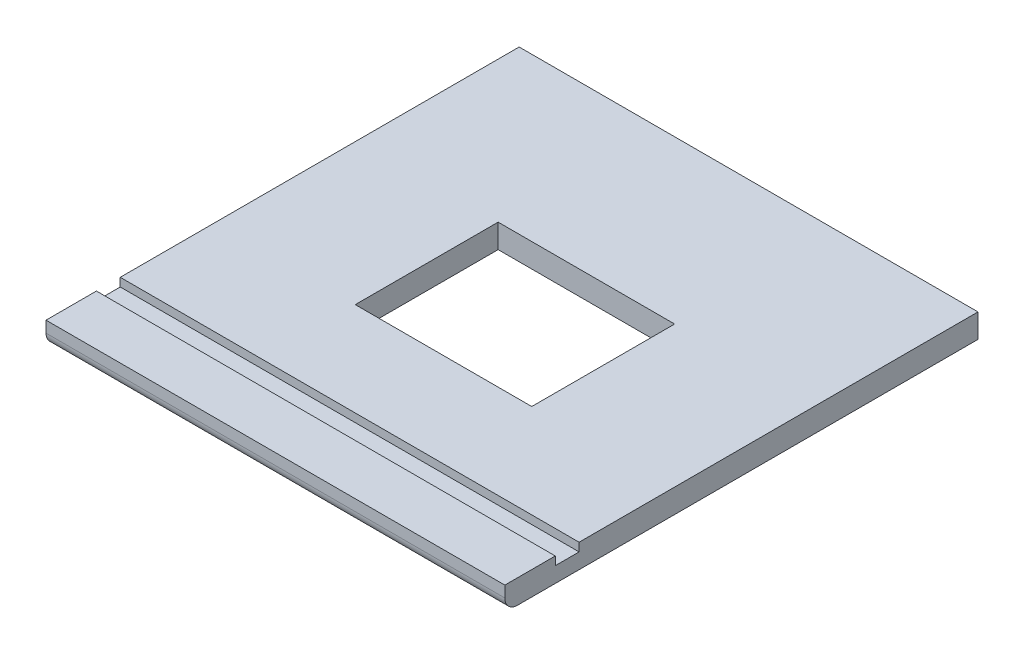
ISO-10303-21;
HEADER;
FILE_DESCRIPTION(('STEP AP214'),'2;1');
FILE_NAME('part.step','',(''),(''),'','','');
FILE_SCHEMA(('AUTOMOTIVE_DESIGN { 1 0 10303 214 1 1 1 1 }'));
ENDSEC;
DATA;
#1=APPLICATION_CONTEXT('core data for automotive mechanical design processes');
#2=APPLICATION_PROTOCOL_DEFINITION('international standard','automotive_design',2000,#1);
#3=PRODUCT_CONTEXT('',#1,'mechanical');
#4=PRODUCT('Part','Part','',(#3));
#5=PRODUCT_RELATED_PRODUCT_CATEGORY('part','',(#4));
#6=PRODUCT_DEFINITION_FORMATION('','',#4);
#7=PRODUCT_DEFINITION_CONTEXT('part definition',#1,'design');
#8=PRODUCT_DEFINITION('design','',#6,#7);
#9=PRODUCT_DEFINITION_SHAPE('','',#8);
#10=(LENGTH_UNIT() NAMED_UNIT(*) SI_UNIT(.MILLI.,.METRE.));
#11=(NAMED_UNIT(*) PLANE_ANGLE_UNIT() SI_UNIT($,.RADIAN.));
#12=(NAMED_UNIT(*) SI_UNIT($,.STERADIAN.) SOLID_ANGLE_UNIT());
#13=UNCERTAINTY_MEASURE_WITH_UNIT(LENGTH_MEASURE(1.E-05),#10,'distance_accuracy_value','');
#14=(GEOMETRIC_REPRESENTATION_CONTEXT(3) GLOBAL_UNCERTAINTY_ASSIGNED_CONTEXT((#13)) GLOBAL_UNIT_ASSIGNED_CONTEXT((#10,
#11,#12)) REPRESENTATION_CONTEXT('',''));
#15=CARTESIAN_POINT('',(0.,0.,0.));
#16=DIRECTION('',(0.,0.,1.));
#17=DIRECTION('',(1.,0.,0.));
#18=AXIS2_PLACEMENT_3D('',#15,#16,#17);
#19=CARTESIAN_POINT('',(0.,18.,0.));
#20=DIRECTION('',(0.,1.,0.));
#21=DIRECTION('',(0.,0.,1.));
#22=AXIS2_PLACEMENT_3D('',#19,#20,#21);
#23=PLANE('',#22);
#24=DIRECTION('',(1.,0.,0.));
#25=VECTOR('',#24,1.);
#26=CARTESIAN_POINT('',(346.7,18.,319.40000001));
#27=LINE('',#26,#25);
#28=CARTESIAN_POINT('',(0.,18.,319.40000001));
#29=VERTEX_POINT('',#28);
#30=CARTESIAN_POINT('',(346.7,18.,319.40000001));
#31=VERTEX_POINT('',#30);
#32=EDGE_CURVE('E173',#29,#31,#27,.T.);
#33=ORIENTED_EDGE('',*,*,#32,.F.);
#34=DIRECTION('',(0.,0.,1.));
#35=VECTOR('',#34,1.);
#36=CARTESIAN_POINT('',(0.,18.,0.));
#37=LINE('',#36,#35);
#38=CARTESIAN_POINT('',(0.,18.,357.50000001));
#39=VERTEX_POINT('',#38);
#40=EDGE_CURVE('E198',#29,#39,#37,.T.);
#41=ORIENTED_EDGE('',*,*,#40,.T.);
#42=DIRECTION('',(1.,0.,0.));
#43=VECTOR('',#42,1.);
#44=CARTESIAN_POINT('',(0.,18.,357.50000001));
#45=LINE('',#44,#43);
#46=CARTESIAN_POINT('',(346.7,18.,357.50000001));
#47=VERTEX_POINT('',#46);
#48=EDGE_CURVE('E197',#39,#47,#45,.T.);
#49=ORIENTED_EDGE('',*,*,#48,.T.);
#50=DIRECTION('',(0.,0.,-1.));
#51=VECTOR('',#50,1.);
#52=CARTESIAN_POINT('',(346.7,18.,0.));
#53=LINE('',#52,#51);
#54=EDGE_CURVE('E201',#47,#31,#53,.T.);
#55=ORIENTED_EDGE('',*,*,#54,.T.);
#56=EDGE_LOOP('',(#33,#41,#49,#55));
#57=FACE_BOUND('',#56,.T.);
#58=ADVANCED_FACE('F32',(#57),#23,.T.);
#59=CARTESIAN_POINT('',(0.,18.,0.));
#60=DIRECTION('',(1.,0.,0.));
#61=DIRECTION('',(0.,0.,-1.));
#62=AXIS2_PLACEMENT_3D('',#59,#60,#61);
#63=PLANE('',#62);
#64=DIRECTION('',(0.,0.,1.));
#65=VECTOR('',#64,1.);
#66=CARTESIAN_POINT('',(0.,0.,0.));
#67=LINE('',#66,#65);
#68=CARTESIAN_POINT('',(0.,0.,0.));
#69=VERTEX_POINT('',#68);
#70=CARTESIAN_POINT('',(0.,0.,347.97500001));
#71=VERTEX_POINT('',#70);
#72=EDGE_CURVE('E187',#69,#71,#67,.T.);
#73=ORIENTED_EDGE('',*,*,#72,.T.);
#74=CARTESIAN_POINT('',(0.,9.525,347.97500001));
#75=DIRECTION('',(1.,0.,0.));
#76=DIRECTION('',(0.,0.,-1.));
#77=AXIS2_PLACEMENT_3D('',#74,#75,#76);
#78=CIRCLE('',#77,9.525);
#79=CARTESIAN_POINT('',(0.,9.525,357.50000001));
#80=VERTEX_POINT('',#79);
#81=EDGE_CURVE('E11',#71,#80,#78,.F.);
#82=ORIENTED_EDGE('',*,*,#81,.T.);
#83=DIRECTION('',(0.,-1.,0.));
#84=VECTOR('',#83,1.);
#85=CARTESIAN_POINT('',(0.,18.,357.50000001));
#86=LINE('',#85,#84);
#87=EDGE_CURVE('E219',#39,#80,#86,.T.);
#88=ORIENTED_EDGE('',*,*,#87,.F.);
#89=ORIENTED_EDGE('',*,*,#40,.F.);
#90=DIRECTION('',(0.,1.,0.));
#91=VECTOR('',#90,1.);
#92=CARTESIAN_POINT('',(0.,11.65,319.40000001));
#93=LINE('',#92,#91);
#94=CARTESIAN_POINT('',(0.,11.65,319.40000001));
#95=VERTEX_POINT('',#94);
#96=EDGE_CURVE('E188',#95,#29,#93,.T.);
#97=ORIENTED_EDGE('',*,*,#96,.F.);
#98=DIRECTION('',(0.,0.,1.));
#99=VECTOR('',#98,1.);
#100=CARTESIAN_POINT('',(0.,11.65,319.40000001));
#101=LINE('',#100,#99);
#102=CARTESIAN_POINT('',(0.,11.65,301.40000001));
#103=VERTEX_POINT('',#102);
#104=EDGE_CURVE('E176',#103,#95,#101,.T.);
#105=ORIENTED_EDGE('',*,*,#104,.F.);
#106=DIRECTION('',(0.,1.,0.));
#107=VECTOR('',#106,1.);
#108=CARTESIAN_POINT('',(0.,11.65,301.40000001));
#109=LINE('',#108,#107);
#110=CARTESIAN_POINT('',(0.,18.,301.40000001));
#111=VERTEX_POINT('',#110);
#112=EDGE_CURVE('E190',#103,#111,#109,.T.);
#113=ORIENTED_EDGE('',*,*,#112,.T.);
#114=CARTESIAN_POINT('',(0.,18.,0.));
#115=VERTEX_POINT('',#114);
#116=EDGE_CURVE('E194',#115,#111,#37,.T.);
#117=ORIENTED_EDGE('',*,*,#116,.F.);
#118=DIRECTION('',(0.,-1.,0.));
#119=VECTOR('',#118,1.);
#120=CARTESIAN_POINT('',(0.,18.,0.));
#121=LINE('',#120,#119);
#122=EDGE_CURVE('E206',#115,#69,#121,.T.);
#123=ORIENTED_EDGE('',*,*,#122,.T.);
#124=EDGE_LOOP('',(#73,#82,#88,#89,#97,#105,#113,#117,#123));
#125=FACE_BOUND('',#124,.T.);
#126=ADVANCED_FACE('F240',(#125),#63,.F.);
#127=CARTESIAN_POINT('',(0.,18.,357.50000001));
#128=DIRECTION('',(0.,0.,-1.));
#129=DIRECTION('',(-1.,0.,0.));
#130=AXIS2_PLACEMENT_3D('',#127,#128,#129);
#131=PLANE('',#130);
#132=ORIENTED_EDGE('',*,*,#87,.T.);
#133=DIRECTION('',(1.,0.,0.));
#134=VECTOR('',#133,1.);
#135=CARTESIAN_POINT('',(0.,9.525,357.50000001));
#136=LINE('',#135,#134);
#137=CARTESIAN_POINT('',(346.7,9.525,357.50000001));
#138=VERTEX_POINT('',#137);
#139=EDGE_CURVE('E222',#80,#138,#136,.T.);
#140=ORIENTED_EDGE('',*,*,#139,.T.);
#141=DIRECTION('',(0.,-1.,0.));
#142=VECTOR('',#141,1.);
#143=CARTESIAN_POINT('',(346.7,18.,357.50000001));
#144=LINE('',#143,#142);
#145=EDGE_CURVE('E217',#47,#138,#144,.T.);
#146=ORIENTED_EDGE('',*,*,#145,.F.);
#147=ORIENTED_EDGE('',*,*,#48,.F.);
#148=EDGE_LOOP('',(#132,#140,#146,#147));
#149=FACE_BOUND('',#148,.T.);
#150=ADVANCED_FACE('F228',(#149),#131,.F.);
#151=CARTESIAN_POINT('',(346.7,18.,0.));
#152=DIRECTION('',(-1.,0.,0.));
#153=DIRECTION('',(0.,0.,1.));
#154=AXIS2_PLACEMENT_3D('',#151,#152,#153);
#155=PLANE('',#154);
#156=ORIENTED_EDGE('',*,*,#145,.T.);
#157=CARTESIAN_POINT('',(346.7,9.525,347.97500001));
#158=DIRECTION('',(-1.,0.,0.));
#159=DIRECTION('',(0.,0.,1.));
#160=AXIS2_PLACEMENT_3D('',#157,#158,#159);
#161=CIRCLE('',#160,9.525);
#162=CARTESIAN_POINT('',(346.7,0.,347.97500001));
#163=VERTEX_POINT('',#162);
#164=EDGE_CURVE('E54',#138,#163,#161,.F.);
#165=ORIENTED_EDGE('',*,*,#164,.T.);
#166=DIRECTION('',(0.,0.,-1.));
#167=VECTOR('',#166,1.);
#168=CARTESIAN_POINT('',(346.7,0.,0.));
#169=LINE('',#168,#167);
#170=CARTESIAN_POINT('',(346.7,0.,0.));
#171=VERTEX_POINT('',#170);
#172=EDGE_CURVE('E208',#163,#171,#169,.T.);
#173=ORIENTED_EDGE('',*,*,#172,.T.);
#174=DIRECTION('',(0.,-1.,0.));
#175=VECTOR('',#174,1.);
#176=CARTESIAN_POINT('',(346.7,18.,0.));
#177=LINE('',#176,#175);
#178=CARTESIAN_POINT('',(346.7,18.,0.));
#179=VERTEX_POINT('',#178);
#180=EDGE_CURVE('E214',#179,#171,#177,.T.);
#181=ORIENTED_EDGE('',*,*,#180,.F.);
#182=CARTESIAN_POINT('',(346.7,18.,301.40000001));
#183=VERTEX_POINT('',#182);
#184=EDGE_CURVE('E200',#183,#179,#53,.T.);
#185=ORIENTED_EDGE('',*,*,#184,.F.);
#186=DIRECTION('',(0.,1.,0.));
#187=VECTOR('',#186,1.);
#188=CARTESIAN_POINT('',(346.7,11.65,301.40000001));
#189=LINE('',#188,#187);
#190=CARTESIAN_POINT('',(346.7,11.65,301.40000001));
#191=VERTEX_POINT('',#190);
#192=EDGE_CURVE('E181',#191,#183,#189,.T.);
#193=ORIENTED_EDGE('',*,*,#192,.F.);
#194=DIRECTION('',(0.,0.,-1.));
#195=VECTOR('',#194,1.);
#196=CARTESIAN_POINT('',(346.7,11.65,319.40000001));
#197=LINE('',#196,#195);
#198=CARTESIAN_POINT('',(346.7,11.65,319.40000001));
#199=VERTEX_POINT('',#198);
#200=EDGE_CURVE('E169',#199,#191,#197,.T.);
#201=ORIENTED_EDGE('',*,*,#200,.F.);
#202=DIRECTION('',(0.,1.,0.));
#203=VECTOR('',#202,1.);
#204=CARTESIAN_POINT('',(346.7,11.65,319.40000001));
#205=LINE('',#204,#203);
#206=EDGE_CURVE('E184',#199,#31,#205,.T.);
#207=ORIENTED_EDGE('',*,*,#206,.T.);
#208=ORIENTED_EDGE('',*,*,#54,.F.);
#209=EDGE_LOOP('',(#156,#165,#173,#181,#185,#193,#201,#207,#208));
#210=FACE_BOUND('',#209,.T.);
#211=ADVANCED_FACE('F234',(#210),#155,.F.);
#212=CARTESIAN_POINT('',(0.,18.,0.));
#213=DIRECTION('',(0.,0.,1.));
#214=DIRECTION('',(1.,0.,0.));
#215=AXIS2_PLACEMENT_3D('',#212,#213,#214);
#216=PLANE('',#215);
#217=DIRECTION('',(-1.,0.,0.));
#218=VECTOR('',#217,1.);
#219=CARTESIAN_POINT('',(0.,0.,0.));
#220=LINE('',#219,#218);
#221=EDGE_CURVE('E210',#171,#69,#220,.T.);
#222=ORIENTED_EDGE('',*,*,#221,.T.);
#223=ORIENTED_EDGE('',*,*,#122,.F.);
#224=DIRECTION('',(-1.,0.,0.));
#225=VECTOR('',#224,1.);
#226=CARTESIAN_POINT('',(0.,18.,0.));
#227=LINE('',#226,#225);
#228=EDGE_CURVE('E204',#179,#115,#227,.T.);
#229=ORIENTED_EDGE('',*,*,#228,.F.);
#230=ORIENTED_EDGE('',*,*,#180,.T.);
#231=EDGE_LOOP('',(#222,#223,#229,#230));
#232=FACE_BOUND('',#231,.T.);
#233=ADVANCED_FACE('F258',(#232),#216,.F.);
#234=DIRECTION('',(0.,0.,1.));
#235=VECTOR('',#234,1.);
#236=CARTESIAN_POINT('',(106.675,18.,230.50000001));
#237=LINE('',#236,#235);
#238=CARTESIAN_POINT('',(106.675,18.,122.55000001));
#239=VERTEX_POINT('',#238);
#240=CARTESIAN_POINT('',(106.675,18.,230.50000001));
#241=VERTEX_POINT('',#240);
#242=EDGE_CURVE('E133',#239,#241,#237,.T.);
#243=ORIENTED_EDGE('',*,*,#242,.F.);
#244=DIRECTION('',(-1.,0.,0.));
#245=VECTOR('',#244,1.);
#246=CARTESIAN_POINT('',(106.675,18.,122.55000001));
#247=LINE('',#246,#245);
#248=CARTESIAN_POINT('',(240.025,18.,122.55000001));
#249=VERTEX_POINT('',#248);
#250=EDGE_CURVE('E150',#249,#239,#247,.T.);
#251=ORIENTED_EDGE('',*,*,#250,.F.);
#252=DIRECTION('',(0.,0.,-1.));
#253=VECTOR('',#252,1.);
#254=CARTESIAN_POINT('',(240.025,18.,230.50000001));
#255=LINE('',#254,#253);
#256=CARTESIAN_POINT('',(240.025,18.,230.50000001));
#257=VERTEX_POINT('',#256);
#258=EDGE_CURVE('E153',#257,#249,#255,.T.);
#259=ORIENTED_EDGE('',*,*,#258,.F.);
#260=DIRECTION('',(1.,0.,0.));
#261=VECTOR('',#260,1.);
#262=CARTESIAN_POINT('',(106.675,18.,230.50000001));
#263=LINE('',#262,#261);
#264=EDGE_CURVE('E159',#241,#257,#263,.T.);
#265=ORIENTED_EDGE('',*,*,#264,.F.);
#266=EDGE_LOOP('',(#243,#251,#259,#265));
#267=FACE_BOUND('',#266,.T.);
#268=DIRECTION('',(-1.,0.,0.));
#269=VECTOR('',#268,1.);
#270=CARTESIAN_POINT('',(346.7,18.,301.40000001));
#271=LINE('',#270,#269);
#272=EDGE_CURVE('E165',#183,#111,#271,.T.);
#273=ORIENTED_EDGE('',*,*,#272,.F.);
#274=ORIENTED_EDGE('',*,*,#184,.T.);
#275=ORIENTED_EDGE('',*,*,#228,.T.);
#276=ORIENTED_EDGE('',*,*,#116,.T.);
#277=EDGE_LOOP('',(#273,#274,#275,#276));
#278=FACE_BOUND('',#277,.T.);
#279=ADVANCED_FACE('F250',(#267,#278),#23,.T.);
#280=CARTESIAN_POINT('',(0.,0.,0.));
#281=DIRECTION('',(0.,1.,0.));
#282=DIRECTION('',(0.,0.,1.));
#283=AXIS2_PLACEMENT_3D('',#280,#281,#282);
#284=PLANE('',#283);
#285=DIRECTION('',(-1.,0.,0.));
#286=VECTOR('',#285,1.);
#287=CARTESIAN_POINT('',(106.675,0.,122.55000001));
#288=LINE('',#287,#286);
#289=CARTESIAN_POINT('',(240.025,0.,122.55000001));
#290=VERTEX_POINT('',#289);
#291=CARTESIAN_POINT('',(106.675,0.,122.55000001));
#292=VERTEX_POINT('',#291);
#293=EDGE_CURVE('E138',#290,#292,#288,.T.);
#294=ORIENTED_EDGE('',*,*,#293,.T.);
#295=DIRECTION('',(0.,0.,1.));
#296=VECTOR('',#295,1.);
#297=CARTESIAN_POINT('',(106.675,0.,230.50000001));
#298=LINE('',#297,#296);
#299=CARTESIAN_POINT('',(106.675,0.,230.50000001));
#300=VERTEX_POINT('',#299);
#301=EDGE_CURVE('E130',#292,#300,#298,.T.);
#302=ORIENTED_EDGE('',*,*,#301,.T.);
#303=DIRECTION('',(1.,0.,0.));
#304=VECTOR('',#303,1.);
#305=CARTESIAN_POINT('',(106.675,0.,230.50000001));
#306=LINE('',#305,#304);
#307=CARTESIAN_POINT('',(240.025,0.,230.50000001));
#308=VERTEX_POINT('',#307);
#309=EDGE_CURVE('E142',#300,#308,#306,.T.);
#310=ORIENTED_EDGE('',*,*,#309,.T.);
#311=DIRECTION('',(0.,0.,-1.));
#312=VECTOR('',#311,1.);
#313=CARTESIAN_POINT('',(240.025,0.,230.50000001));
#314=LINE('',#313,#312);
#315=EDGE_CURVE('E146',#308,#290,#314,.T.);
#316=ORIENTED_EDGE('',*,*,#315,.T.);
#317=EDGE_LOOP('',(#294,#302,#310,#316));
#318=FACE_BOUND('',#317,.T.);
#319=ORIENTED_EDGE('',*,*,#172,.F.);
#320=DIRECTION('',(1.,0.,0.));
#321=VECTOR('',#320,1.);
#322=CARTESIAN_POINT('',(0.,0.,347.97500001));
#323=LINE('',#322,#321);
#324=EDGE_CURVE('E40',#163,#71,#323,.F.);
#325=ORIENTED_EDGE('',*,*,#324,.T.);
#326=ORIENTED_EDGE('',*,*,#72,.F.);
#327=ORIENTED_EDGE('',*,*,#221,.F.);
#328=EDGE_LOOP('',(#319,#325,#326,#327));
#329=FACE_BOUND('',#328,.T.);
#330=ADVANCED_FACE('F148',(#318,#329),#284,.F.);
#331=CARTESIAN_POINT('',(346.7,11.65,319.40000001));
#332=DIRECTION('',(0.,0.,1.));
#333=DIRECTION('',(1.,0.,0.));
#334=AXIS2_PLACEMENT_3D('',#331,#332,#333);
#335=PLANE('',#334);
#336=ORIENTED_EDGE('',*,*,#32,.T.);
#337=ORIENTED_EDGE('',*,*,#206,.F.);
#338=DIRECTION('',(1.,0.,0.));
#339=VECTOR('',#338,1.);
#340=CARTESIAN_POINT('',(346.7,11.65,319.40000001));
#341=LINE('',#340,#339);
#342=EDGE_CURVE('E178',#95,#199,#341,.T.);
#343=ORIENTED_EDGE('',*,*,#342,.F.);
#344=ORIENTED_EDGE('',*,*,#96,.T.);
#345=EDGE_LOOP('',(#336,#337,#343,#344));
#346=FACE_BOUND('',#345,.T.);
#347=ADVANCED_FACE('F265',(#346),#335,.F.);
#348=CARTESIAN_POINT('',(346.7,11.65,301.40000001));
#349=DIRECTION('',(0.,0.,-1.));
#350=DIRECTION('',(-1.,0.,0.));
#351=AXIS2_PLACEMENT_3D('',#348,#349,#350);
#352=PLANE('',#351);
#353=ORIENTED_EDGE('',*,*,#272,.T.);
#354=ORIENTED_EDGE('',*,*,#112,.F.);
#355=DIRECTION('',(-1.,0.,0.));
#356=VECTOR('',#355,1.);
#357=CARTESIAN_POINT('',(346.7,11.65,301.40000001));
#358=LINE('',#357,#356);
#359=EDGE_CURVE('E172',#191,#103,#358,.T.);
#360=ORIENTED_EDGE('',*,*,#359,.F.);
#361=ORIENTED_EDGE('',*,*,#192,.T.);
#362=EDGE_LOOP('',(#353,#354,#360,#361));
#363=FACE_BOUND('',#362,.T.);
#364=ADVANCED_FACE('F281',(#363),#352,.F.);
#365=CARTESIAN_POINT('',(0.,11.65,0.));
#366=DIRECTION('',(0.,1.,0.));
#367=DIRECTION('',(0.,0.,1.));
#368=AXIS2_PLACEMENT_3D('',#365,#366,#367);
#369=PLANE('',#368);
#370=ORIENTED_EDGE('',*,*,#200,.T.);
#371=ORIENTED_EDGE('',*,*,#359,.T.);
#372=ORIENTED_EDGE('',*,*,#104,.T.);
#373=ORIENTED_EDGE('',*,*,#342,.T.);
#374=EDGE_LOOP('',(#370,#371,#372,#373));
#375=FACE_BOUND('',#374,.T.);
#376=ADVANCED_FACE('F283',(#375),#369,.T.);
#377=CARTESIAN_POINT('',(106.675,0.,230.50000001));
#378=DIRECTION('',(-1.,0.,0.));
#379=DIRECTION('',(0.,0.,1.));
#380=AXIS2_PLACEMENT_3D('',#377,#378,#379);
#381=PLANE('',#380);
#382=ORIENTED_EDGE('',*,*,#242,.T.);
#383=DIRECTION('',(0.,1.,0.));
#384=VECTOR('',#383,1.);
#385=CARTESIAN_POINT('',(106.675,0.,230.50000001));
#386=LINE('',#385,#384);
#387=EDGE_CURVE('E126',#300,#241,#386,.T.);
#388=ORIENTED_EDGE('',*,*,#387,.F.);
#389=ORIENTED_EDGE('',*,*,#301,.F.);
#390=DIRECTION('',(0.,1.,0.));
#391=VECTOR('',#390,1.);
#392=CARTESIAN_POINT('',(106.675,0.,122.55000001));
#393=LINE('',#392,#391);
#394=EDGE_CURVE('E163',#292,#239,#393,.T.);
#395=ORIENTED_EDGE('',*,*,#394,.T.);
#396=EDGE_LOOP('',(#382,#388,#389,#395));
#397=FACE_BOUND('',#396,.T.);
#398=ADVANCED_FACE('F128',(#397),#381,.F.);
#399=CARTESIAN_POINT('',(106.675,0.,122.55000001));
#400=DIRECTION('',(0.,0.,-1.));
#401=DIRECTION('',(-1.,0.,0.));
#402=AXIS2_PLACEMENT_3D('',#399,#400,#401);
#403=PLANE('',#402);
#404=ORIENTED_EDGE('',*,*,#250,.T.);
#405=ORIENTED_EDGE('',*,*,#394,.F.);
#406=ORIENTED_EDGE('',*,*,#293,.F.);
#407=DIRECTION('',(0.,1.,0.));
#408=VECTOR('',#407,1.);
#409=CARTESIAN_POINT('',(240.025,0.,122.55000001));
#410=LINE('',#409,#408);
#411=EDGE_CURVE('E166',#290,#249,#410,.T.);
#412=ORIENTED_EDGE('',*,*,#411,.T.);
#413=EDGE_LOOP('',(#404,#405,#406,#412));
#414=FACE_BOUND('',#413,.T.);
#415=ADVANCED_FACE('F296',(#414),#403,.F.);
#416=CARTESIAN_POINT('',(240.025,0.,230.50000001));
#417=DIRECTION('',(1.,0.,0.));
#418=DIRECTION('',(0.,0.,-1.));
#419=AXIS2_PLACEMENT_3D('',#416,#417,#418);
#420=PLANE('',#419);
#421=ORIENTED_EDGE('',*,*,#258,.T.);
#422=ORIENTED_EDGE('',*,*,#411,.F.);
#423=ORIENTED_EDGE('',*,*,#315,.F.);
#424=DIRECTION('',(0.,1.,0.));
#425=VECTOR('',#424,1.);
#426=CARTESIAN_POINT('',(240.025,0.,230.50000001));
#427=LINE('',#426,#425);
#428=EDGE_CURVE('E137',#308,#257,#427,.T.);
#429=ORIENTED_EDGE('',*,*,#428,.T.);
#430=EDGE_LOOP('',(#421,#422,#423,#429));
#431=FACE_BOUND('',#430,.T.);
#432=ADVANCED_FACE('F246',(#431),#420,.F.);
#433=CARTESIAN_POINT('',(106.675,0.,230.50000001));
#434=DIRECTION('',(0.,0.,1.));
#435=DIRECTION('',(1.,0.,0.));
#436=AXIS2_PLACEMENT_3D('',#433,#434,#435);
#437=PLANE('',#436);
#438=ORIENTED_EDGE('',*,*,#264,.T.);
#439=ORIENTED_EDGE('',*,*,#428,.F.);
#440=ORIENTED_EDGE('',*,*,#309,.F.);
#441=ORIENTED_EDGE('',*,*,#387,.T.);
#442=EDGE_LOOP('',(#438,#439,#440,#441));
#443=FACE_BOUND('',#442,.T.);
#444=ADVANCED_FACE('F143',(#443),#437,.F.);
#445=CARTESIAN_POINT('',(0.,9.525,347.97500001));
#446=DIRECTION('',(1.,0.,0.));
#447=DIRECTION('',(0.,0.,-1.));
#448=AXIS2_PLACEMENT_3D('',#445,#446,#447);
#449=CYLINDRICAL_SURFACE('',#448,9.525);
#450=ORIENTED_EDGE('',*,*,#81,.F.);
#451=ORIENTED_EDGE('',*,*,#324,.F.);
#452=ORIENTED_EDGE('',*,*,#164,.F.);
#453=ORIENTED_EDGE('',*,*,#139,.F.);
#454=EDGE_LOOP('',(#450,#451,#452,#453));
#455=FACE_BOUND('',#454,.T.);
#456=ADVANCED_FACE('F34',(#455),#449,.T.);
#457=CLOSED_SHELL('',(#58,#126,#150,#211,#233,#279,#330,#347,#364,#376,#398,#415,#432,#444,#456));
#458=MANIFOLD_SOLID_BREP('B2',#457);
#459=ADVANCED_BREP_SHAPE_REPRESENTATION('',(#18,#458),#14);
#460=SHAPE_DEFINITION_REPRESENTATION(#9,#459);
ENDSEC;
END-ISO-10303-21;
